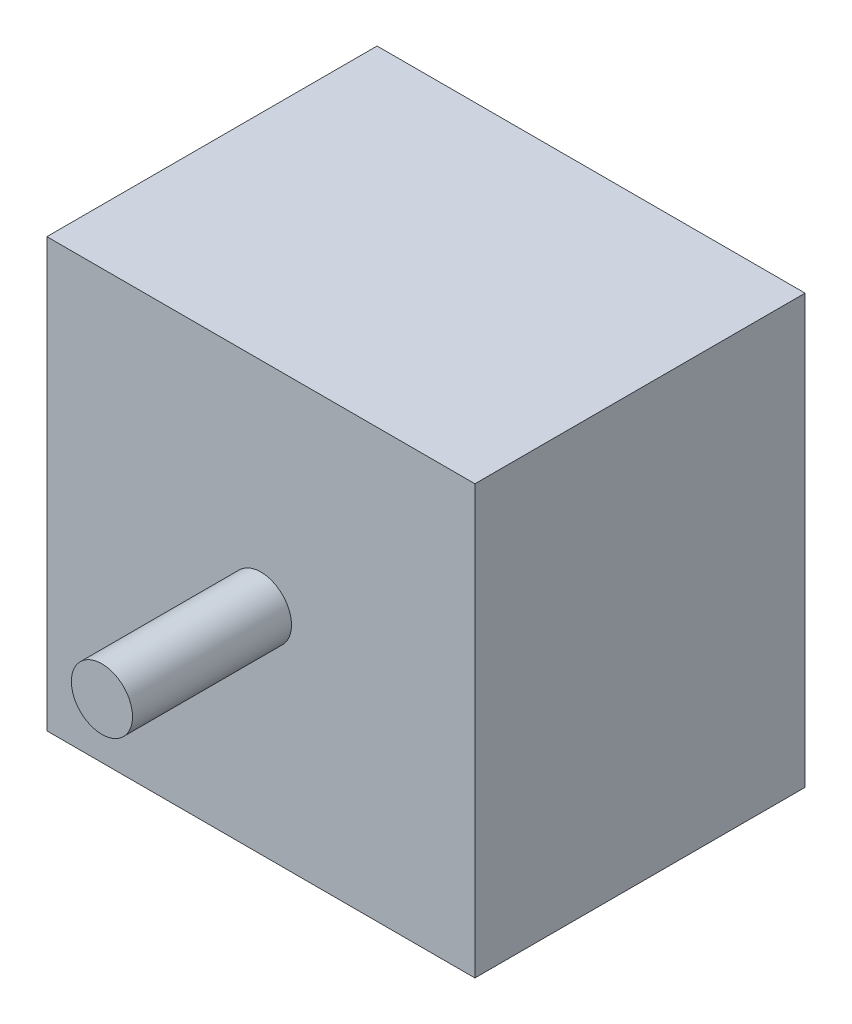
ISO-10303-21;
HEADER;
FILE_DESCRIPTION(('STEP AP214'),'2;1');
FILE_NAME('part.step','',(''),(''),'','','');
FILE_SCHEMA(('AUTOMOTIVE_DESIGN { 1 0 10303 214 1 1 1 1 }'));
ENDSEC;
DATA;
#1=APPLICATION_CONTEXT('core data for automotive mechanical design processes');
#2=APPLICATION_PROTOCOL_DEFINITION('international standard','automotive_design',2000,#1);
#3=PRODUCT_CONTEXT('',#1,'mechanical');
#4=PRODUCT('Part','Part','',(#3));
#5=PRODUCT_RELATED_PRODUCT_CATEGORY('part','',(#4));
#6=PRODUCT_DEFINITION_FORMATION('','',#4);
#7=PRODUCT_DEFINITION_CONTEXT('part definition',#1,'design');
#8=PRODUCT_DEFINITION('design','',#6,#7);
#9=PRODUCT_DEFINITION_SHAPE('','',#8);
#10=(LENGTH_UNIT() NAMED_UNIT(*) SI_UNIT(.MILLI.,.METRE.));
#11=(NAMED_UNIT(*) PLANE_ANGLE_UNIT() SI_UNIT($,.RADIAN.));
#12=(NAMED_UNIT(*) SI_UNIT($,.STERADIAN.) SOLID_ANGLE_UNIT());
#13=UNCERTAINTY_MEASURE_WITH_UNIT(LENGTH_MEASURE(1.E-05),#10,'distance_accuracy_value','');
#14=(GEOMETRIC_REPRESENTATION_CONTEXT(3) GLOBAL_UNCERTAINTY_ASSIGNED_CONTEXT((#13)) GLOBAL_UNIT_ASSIGNED_CONTEXT((#10,
#11,#12)) REPRESENTATION_CONTEXT('',''));
#15=CARTESIAN_POINT('',(0.,0.,0.));
#16=DIRECTION('',(0.,0.,1.));
#17=DIRECTION('',(1.,0.,0.));
#18=AXIS2_PLACEMENT_3D('',#15,#16,#17);
#19=CARTESIAN_POINT('',(0.,0.,27.));
#20=DIRECTION('',(0.,1.,0.));
#21=DIRECTION('',(0.,0.,1.));
#22=AXIS2_PLACEMENT_3D('',#19,#20,#21);
#23=PLANE('',#22);
#24=DIRECTION('',(1.,0.,0.));
#25=VECTOR('',#24,1.);
#26=CARTESIAN_POINT('',(0.,0.,0.));
#27=LINE('',#26,#25);
#28=CARTESIAN_POINT('',(0.,0.,0.));
#29=VERTEX_POINT('',#28);
#30=CARTESIAN_POINT('',(35.,0.,0.));
#31=VERTEX_POINT('',#30);
#32=EDGE_CURVE('E107',#29,#31,#27,.T.);
#33=ORIENTED_EDGE('',*,*,#32,.T.);
#34=DIRECTION('',(0.,0.,-1.));
#35=VECTOR('',#34,1.);
#36=CARTESIAN_POINT('',(35.,0.,27.));
#37=LINE('',#36,#35);
#38=CARTESIAN_POINT('',(35.,0.,27.));
#39=VERTEX_POINT('',#38);
#40=EDGE_CURVE('E11',#39,#31,#37,.T.);
#41=ORIENTED_EDGE('',*,*,#40,.F.);
#42=DIRECTION('',(1.,0.,0.));
#43=VECTOR('',#42,1.);
#44=CARTESIAN_POINT('',(0.,0.,27.));
#45=LINE('',#44,#43);
#46=CARTESIAN_POINT('',(0.,0.,27.));
#47=VERTEX_POINT('',#46);
#48=EDGE_CURVE('E89',#47,#39,#45,.T.);
#49=ORIENTED_EDGE('',*,*,#48,.F.);
#50=DIRECTION('',(0.,0.,-1.));
#51=VECTOR('',#50,1.);
#52=CARTESIAN_POINT('',(0.,0.,27.));
#53=LINE('',#52,#51);
#54=EDGE_CURVE('E56',#47,#29,#53,.T.);
#55=ORIENTED_EDGE('',*,*,#54,.T.);
#56=EDGE_LOOP('',(#33,#41,#49,#55));
#57=FACE_BOUND('',#56,.T.);
#58=ADVANCED_FACE('F39',(#57),#23,.F.);
#59=CARTESIAN_POINT('',(35.,0.,27.));
#60=DIRECTION('',(-1.,0.,0.));
#61=DIRECTION('',(0.,0.,1.));
#62=AXIS2_PLACEMENT_3D('',#59,#60,#61);
#63=PLANE('',#62);
#64=DIRECTION('',(0.,1.,0.));
#65=VECTOR('',#64,1.);
#66=CARTESIAN_POINT('',(35.,0.,0.));
#67=LINE('',#66,#65);
#68=CARTESIAN_POINT('',(35.,35.,0.));
#69=VERTEX_POINT('',#68);
#70=EDGE_CURVE('E95',#31,#69,#67,.T.);
#71=ORIENTED_EDGE('',*,*,#70,.T.);
#72=DIRECTION('',(0.,0.,-1.));
#73=VECTOR('',#72,1.);
#74=CARTESIAN_POINT('',(35.,35.,27.));
#75=LINE('',#74,#73);
#76=CARTESIAN_POINT('',(35.,35.,27.));
#77=VERTEX_POINT('',#76);
#78=EDGE_CURVE('E48',#77,#69,#75,.T.);
#79=ORIENTED_EDGE('',*,*,#78,.F.);
#80=DIRECTION('',(0.,1.,0.));
#81=VECTOR('',#80,1.);
#82=CARTESIAN_POINT('',(35.,0.,27.));
#83=LINE('',#82,#81);
#84=EDGE_CURVE('E81',#39,#77,#83,.T.);
#85=ORIENTED_EDGE('',*,*,#84,.F.);
#86=ORIENTED_EDGE('',*,*,#40,.T.);
#87=EDGE_LOOP('',(#71,#79,#85,#86));
#88=FACE_BOUND('',#87,.T.);
#89=ADVANCED_FACE('F94',(#88),#63,.F.);
#90=CARTESIAN_POINT('',(0.,35.,27.));
#91=DIRECTION('',(0.,1.,0.));
#92=DIRECTION('',(0.,0.,1.));
#93=AXIS2_PLACEMENT_3D('',#90,#91,#92);
#94=PLANE('',#93);
#95=DIRECTION('',(1.,0.,0.));
#96=VECTOR('',#95,1.);
#97=CARTESIAN_POINT('',(0.,35.,0.));
#98=LINE('',#97,#96);
#99=CARTESIAN_POINT('',(0.,35.,0.));
#100=VERTEX_POINT('',#99);
#101=EDGE_CURVE('E113',#100,#69,#98,.T.);
#102=ORIENTED_EDGE('',*,*,#101,.F.);
#103=DIRECTION('',(0.,0.,-1.));
#104=VECTOR('',#103,1.);
#105=CARTESIAN_POINT('',(0.,35.,27.));
#106=LINE('',#105,#104);
#107=CARTESIAN_POINT('',(0.,35.,27.));
#108=VERTEX_POINT('',#107);
#109=EDGE_CURVE('E70',#108,#100,#106,.T.);
#110=ORIENTED_EDGE('',*,*,#109,.F.);
#111=DIRECTION('',(1.,0.,0.));
#112=VECTOR('',#111,1.);
#113=CARTESIAN_POINT('',(0.,35.,27.));
#114=LINE('',#113,#112);
#115=EDGE_CURVE('E88',#108,#77,#114,.T.);
#116=ORIENTED_EDGE('',*,*,#115,.T.);
#117=ORIENTED_EDGE('',*,*,#78,.T.);
#118=EDGE_LOOP('',(#102,#110,#116,#117));
#119=FACE_BOUND('',#118,.T.);
#120=ADVANCED_FACE('F99',(#119),#94,.T.);
#121=CARTESIAN_POINT('',(0.,0.,27.));
#122=DIRECTION('',(-1.,0.,0.));
#123=DIRECTION('',(0.,0.,1.));
#124=AXIS2_PLACEMENT_3D('',#121,#122,#123);
#125=PLANE('',#124);
#126=DIRECTION('',(0.,1.,0.));
#127=VECTOR('',#126,1.);
#128=CARTESIAN_POINT('',(0.,0.,0.));
#129=LINE('',#128,#127);
#130=EDGE_CURVE('E116',#29,#100,#129,.T.);
#131=ORIENTED_EDGE('',*,*,#130,.F.);
#132=ORIENTED_EDGE('',*,*,#54,.F.);
#133=DIRECTION('',(0.,1.,0.));
#134=VECTOR('',#133,1.);
#135=CARTESIAN_POINT('',(0.,0.,27.));
#136=LINE('',#135,#134);
#137=EDGE_CURVE('E101',#47,#108,#136,.T.);
#138=ORIENTED_EDGE('',*,*,#137,.T.);
#139=ORIENTED_EDGE('',*,*,#109,.T.);
#140=EDGE_LOOP('',(#131,#132,#138,#139));
#141=FACE_BOUND('',#140,.T.);
#142=ADVANCED_FACE('F153',(#141),#125,.T.);
#143=CARTESIAN_POINT('',(0.,0.,27.));
#144=DIRECTION('',(0.,0.,1.));
#145=DIRECTION('',(1.,0.,0.));
#146=AXIS2_PLACEMENT_3D('',#143,#144,#145);
#147=PLANE('',#146);
#148=CARTESIAN_POINT('',(17.5,17.5,27.));
#149=DIRECTION('',(0.,0.,1.));
#150=DIRECTION('',(1.,0.,0.));
#151=AXIS2_PLACEMENT_3D('',#148,#149,#150);
#152=CIRCLE('',#151,2.5);
#153=CARTESIAN_POINT('',(20.,17.5,27.));
#154=VERTEX_POINT('',#153);
#155=EDGE_CURVE('E110',#154,#154,#152,.F.);
#156=ORIENTED_EDGE('',*,*,#155,.T.);
#157=EDGE_LOOP('',(#156));
#158=FACE_BOUND('',#157,.T.);
#159=ORIENTED_EDGE('',*,*,#48,.T.);
#160=ORIENTED_EDGE('',*,*,#84,.T.);
#161=ORIENTED_EDGE('',*,*,#115,.F.);
#162=ORIENTED_EDGE('',*,*,#137,.F.);
#163=EDGE_LOOP('',(#159,#160,#161,#162));
#164=FACE_BOUND('',#163,.T.);
#165=ADVANCED_FACE('F85',(#158,#164),#147,.T.);
#166=CARTESIAN_POINT('',(0.,0.,0.));
#167=DIRECTION('',(0.,0.,1.));
#168=DIRECTION('',(1.,0.,0.));
#169=AXIS2_PLACEMENT_3D('',#166,#167,#168);
#170=PLANE('',#169);
#171=ORIENTED_EDGE('',*,*,#32,.F.);
#172=ORIENTED_EDGE('',*,*,#130,.T.);
#173=ORIENTED_EDGE('',*,*,#101,.T.);
#174=ORIENTED_EDGE('',*,*,#70,.F.);
#175=EDGE_LOOP('',(#171,#172,#173,#174));
#176=FACE_BOUND('',#175,.T.);
#177=ADVANCED_FACE('F138',(#176),#170,.F.);
#178=CARTESIAN_POINT('',(17.5,17.5,40.));
#179=DIRECTION('',(0.,0.,-1.));
#180=DIRECTION('',(-1.,0.,0.));
#181=AXIS2_PLACEMENT_3D('',#178,#179,#180);
#182=CYLINDRICAL_SURFACE('',#181,2.5);
#183=ORIENTED_EDGE('',*,*,#155,.F.);
#184=EDGE_LOOP('',(#183));
#185=FACE_BOUND('',#184,.T.);
#186=CARTESIAN_POINT('',(17.5,17.5,40.));
#187=DIRECTION('',(0.,0.,1.));
#188=DIRECTION('',(1.,0.,0.));
#189=AXIS2_PLACEMENT_3D('',#186,#187,#188);
#190=CIRCLE('',#189,2.5);
#191=CARTESIAN_POINT('',(20.,17.5,40.));
#192=VERTEX_POINT('',#191);
#193=EDGE_CURVE('E129',#192,#192,#190,.T.);
#194=ORIENTED_EDGE('',*,*,#193,.F.);
#195=EDGE_LOOP('',(#194));
#196=FACE_BOUND('',#195,.T.);
#197=ADVANCED_FACE('F136',(#185,#196),#182,.T.);
#198=CARTESIAN_POINT('',(0.,0.,40.));
#199=DIRECTION('',(0.,0.,1.));
#200=DIRECTION('',(1.,0.,0.));
#201=AXIS2_PLACEMENT_3D('',#198,#199,#200);
#202=PLANE('',#201);
#203=ORIENTED_EDGE('',*,*,#193,.T.);
#204=EDGE_LOOP('',(#203));
#205=FACE_BOUND('',#204,.T.);
#206=ADVANCED_FACE('F134',(#205),#202,.T.);
#207=CLOSED_SHELL('',(#58,#89,#120,#142,#165,#177,#197,#206));
#208=MANIFOLD_SOLID_BREP('B2',#207);
#209=ADVANCED_BREP_SHAPE_REPRESENTATION('',(#18,#208),#14);
#210=SHAPE_DEFINITION_REPRESENTATION(#9,#209);
ENDSEC;
END-ISO-10303-21;
